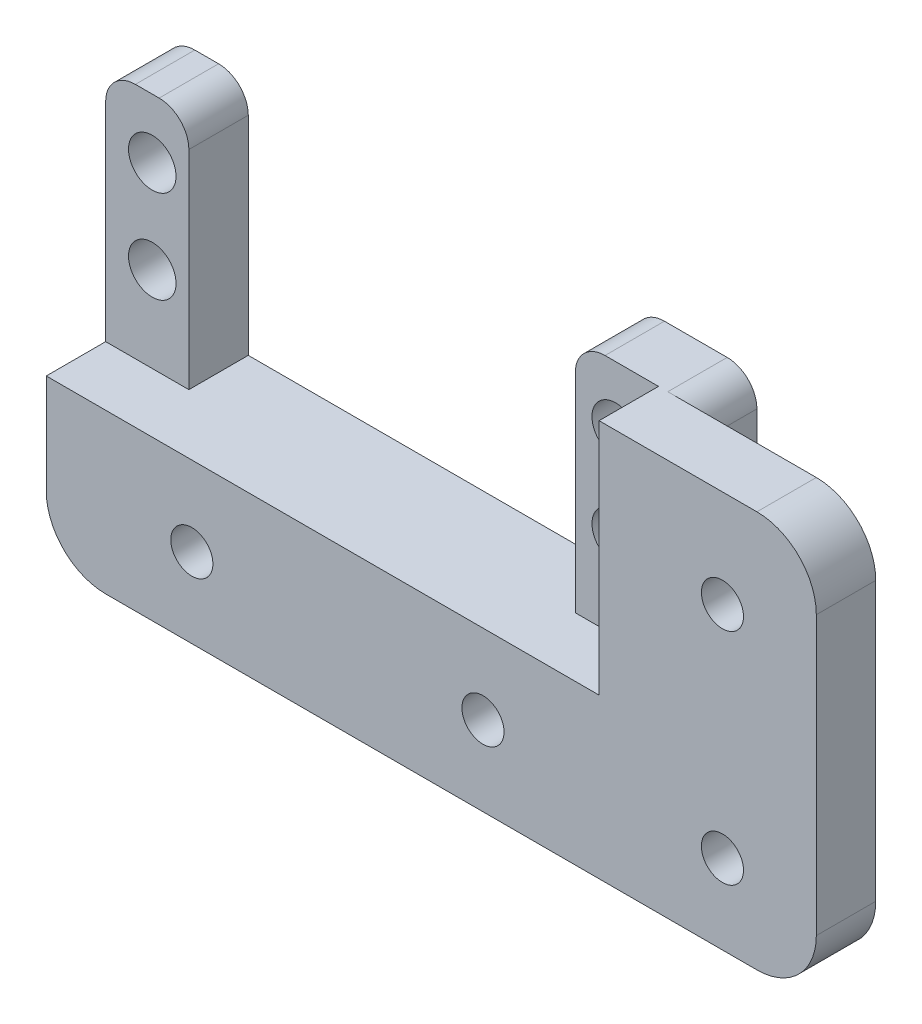
ISO-10303-21;
HEADER;
FILE_DESCRIPTION(('STEP AP214'),'2;1');
FILE_NAME('part.step','',(''),(''),'','','');
FILE_SCHEMA(('AUTOMOTIVE_DESIGN { 1 0 10303 214 1 1 1 1 }'));
ENDSEC;
DATA;
#1=APPLICATION_CONTEXT('core data for automotive mechanical design processes');
#2=APPLICATION_PROTOCOL_DEFINITION('international standard','automotive_design',2000,#1);
#3=PRODUCT_CONTEXT('',#1,'mechanical');
#4=PRODUCT('Part','Part','',(#3));
#5=PRODUCT_RELATED_PRODUCT_CATEGORY('part','',(#4));
#6=PRODUCT_DEFINITION_FORMATION('','',#4);
#7=PRODUCT_DEFINITION_CONTEXT('part definition',#1,'design');
#8=PRODUCT_DEFINITION('design','',#6,#7);
#9=PRODUCT_DEFINITION_SHAPE('','',#8);
#10=(LENGTH_UNIT() NAMED_UNIT(*) SI_UNIT(.MILLI.,.METRE.));
#11=(NAMED_UNIT(*) PLANE_ANGLE_UNIT() SI_UNIT($,.RADIAN.));
#12=(NAMED_UNIT(*) SI_UNIT($,.STERADIAN.) SOLID_ANGLE_UNIT());
#13=UNCERTAINTY_MEASURE_WITH_UNIT(LENGTH_MEASURE(1.E-05),#10,'distance_accuracy_value','');
#14=(GEOMETRIC_REPRESENTATION_CONTEXT(3) GLOBAL_UNCERTAINTY_ASSIGNED_CONTEXT((#13)) GLOBAL_UNIT_ASSIGNED_CONTEXT((#10,
#11,#12)) REPRESENTATION_CONTEXT('',''));
#15=CARTESIAN_POINT('',(0.,0.,0.));
#16=DIRECTION('',(0.,0.,1.));
#17=DIRECTION('',(1.,0.,0.));
#18=AXIS2_PLACEMENT_3D('',#15,#16,#17);
#19=CARTESIAN_POINT('',(3853.51485563994,23.4830508995287,59.608467849632));
#20=DIRECTION('',(0.,0.,-1.));
#21=DIRECTION('',(-1.,0.,0.));
#22=AXIS2_PLACEMENT_3D('',#19,#20,#21);
#23=CYLINDRICAL_SURFACE('',#22,2.25000000000012);
#24=CARTESIAN_POINT('',(3853.51485563994,23.4830508995287,12.7));
#25=DIRECTION('',(0.,0.,1.));
#26=DIRECTION('',(1.,0.,0.));
#27=AXIS2_PLACEMENT_3D('',#24,#25,#26);
#28=CIRCLE('',#27,2.25000000000012);
#29=CARTESIAN_POINT('',(3855.76485563994,23.4830508995287,12.7));
#30=VERTEX_POINT('',#29);
#31=EDGE_CURVE('E411',#30,#30,#28,.F.);
#32=ORIENTED_EDGE('',*,*,#31,.F.);
#33=EDGE_LOOP('',(#32));
#34=FACE_BOUND('',#33,.T.);
#35=CARTESIAN_POINT('',(3853.51485563994,23.4830508995287,6.35));
#36=DIRECTION('',(0.,0.,-1.));
#37=DIRECTION('',(-1.,0.,0.));
#38=AXIS2_PLACEMENT_3D('',#35,#36,#37);
#39=CIRCLE('',#38,2.25000000000012);
#40=CARTESIAN_POINT('',(3851.26485563994,23.4830508995287,6.35));
#41=VERTEX_POINT('',#40);
#42=EDGE_CURVE('E389',#41,#41,#39,.F.);
#43=ORIENTED_EDGE('',*,*,#42,.F.);
#44=EDGE_LOOP('',(#43));
#45=FACE_BOUND('',#44,.T.);
#46=ADVANCED_FACE('F38',(#34,#45),#23,.F.);
#47=CARTESIAN_POINT('',(3853.51485563994,0.,59.608467849632));
#48=DIRECTION('',(0.,0.,-1.));
#49=DIRECTION('',(-1.,0.,0.));
#50=AXIS2_PLACEMENT_3D('',#47,#48,#49);
#51=CYLINDRICAL_SURFACE('',#50,2.25000000000012);
#52=CARTESIAN_POINT('',(3853.51485563994,0.,12.7));
#53=DIRECTION('',(0.,0.,1.));
#54=DIRECTION('',(1.,0.,0.));
#55=AXIS2_PLACEMENT_3D('',#52,#53,#54);
#56=CIRCLE('',#55,2.25000000000012);
#57=CARTESIAN_POINT('',(3855.76485563994,0.,12.7));
#58=VERTEX_POINT('',#57);
#59=EDGE_CURVE('E400',#58,#58,#56,.F.);
#60=ORIENTED_EDGE('',*,*,#59,.F.);
#61=EDGE_LOOP('',(#60));
#62=FACE_BOUND('',#61,.T.);
#63=CARTESIAN_POINT('',(3853.51485563994,0.,6.35));
#64=DIRECTION('',(0.,0.,-1.));
#65=DIRECTION('',(-1.,0.,0.));
#66=AXIS2_PLACEMENT_3D('',#63,#64,#65);
#67=CIRCLE('',#66,2.25000000000012);
#68=CARTESIAN_POINT('',(3851.26485563994,0.,6.35));
#69=VERTEX_POINT('',#68);
#70=EDGE_CURVE('E386',#69,#69,#67,.F.);
#71=ORIENTED_EDGE('',*,*,#70,.F.);
#72=EDGE_LOOP('',(#71));
#73=FACE_BOUND('',#72,.T.);
#74=ADVANCED_FACE('F491',(#62,#73),#51,.F.);
#75=CARTESIAN_POINT('',(3863.54785563994,0.,59.608467849632));
#76=DIRECTION('',(-1.,0.,0.));
#77=DIRECTION('',(0.,0.,1.));
#78=AXIS2_PLACEMENT_3D('',#75,#76,#77);
#79=PLANE('',#78);
#80=DIRECTION('',(0.,-1.,0.));
#81=VECTOR('',#80,1.);
#82=CARTESIAN_POINT('',(3863.54785563994,33.8999999999998,6.35));
#83=LINE('',#82,#81);
#84=CARTESIAN_POINT('',(3863.54785563994,27.5499999999998,6.35));
#85=VERTEX_POINT('',#84);
#86=CARTESIAN_POINT('',(3863.54785563994,-2.14999999999978,6.35));
#87=VERTEX_POINT('',#86);
#88=EDGE_CURVE('E378',#85,#87,#83,.T.);
#89=ORIENTED_EDGE('',*,*,#88,.F.);
#90=DIRECTION('',(0.,0.,-1.));
#91=VECTOR('',#90,1.);
#92=CARTESIAN_POINT('',(3863.54785563994,27.5499999999998,12.7));
#93=LINE('',#92,#91);
#94=CARTESIAN_POINT('',(3863.54785563994,27.5499999999998,12.7));
#95=VERTEX_POINT('',#94);
#96=EDGE_CURVE('E298',#85,#95,#93,.F.);
#97=ORIENTED_EDGE('',*,*,#96,.T.);
#98=DIRECTION('',(0.,1.,0.));
#99=VECTOR('',#98,1.);
#100=CARTESIAN_POINT('',(3863.54785563994,0.,12.7));
#101=LINE('',#100,#99);
#102=CARTESIAN_POINT('',(3863.54785563994,-2.14999999999978,12.7));
#103=VERTEX_POINT('',#102);
#104=EDGE_CURVE('E415',#103,#95,#101,.T.);
#105=ORIENTED_EDGE('',*,*,#104,.F.);
#106=DIRECTION('',(0.,0.,-1.));
#107=VECTOR('',#106,1.);
#108=CARTESIAN_POINT('',(3863.54785563994,-2.14999999999978,59.608467849632));
#109=LINE('',#108,#107);
#110=EDGE_CURVE('E295',#103,#87,#109,.T.);
#111=ORIENTED_EDGE('',*,*,#110,.T.);
#112=EDGE_LOOP('',(#89,#97,#105,#111));
#113=FACE_BOUND('',#112,.T.);
#114=ADVANCED_FACE('F497',(#113),#79,.F.);
#115=CARTESIAN_POINT('',(0.,8.49999999999982,12.7));
#116=DIRECTION('',(0.,1.,0.));
#117=DIRECTION('',(-1.,0.,0.));
#118=AXIS2_PLACEMENT_3D('',#115,#116,#117);
#119=PLANE('',#118);
#120=DIRECTION('',(0.,0.,-1.));
#121=VECTOR('',#120,1.);
#122=CARTESIAN_POINT('',(3790.14185563994,8.49999999999982,0.));
#123=LINE('',#122,#121);
#124=CARTESIAN_POINT('',(3790.14185563994,8.49999999999982,6.35));
#125=VERTEX_POINT('',#124);
#126=CARTESIAN_POINT('',(3790.14185563994,8.50000000000014,0.));
#127=VERTEX_POINT('',#126);
#128=EDGE_CURVE('E183',#125,#127,#123,.T.);
#129=ORIENTED_EDGE('',*,*,#128,.F.);
#130=DIRECTION('',(1.,0.,0.));
#131=VECTOR('',#130,1.);
#132=CARTESIAN_POINT('',(3790.14185563994,8.49999999999982,6.35));
#133=LINE('',#132,#131);
#134=CARTESIAN_POINT('',(3781.25185563994,8.49999999999982,6.35));
#135=VERTEX_POINT('',#134);
#136=EDGE_CURVE('E186',#135,#125,#133,.T.);
#137=ORIENTED_EDGE('',*,*,#136,.F.);
#138=DIRECTION('',(0.,0.,-1.));
#139=VECTOR('',#138,1.);
#140=CARTESIAN_POINT('',(3781.25185563994,8.50000000000014,12.7));
#141=LINE('',#140,#139);
#142=CARTESIAN_POINT('',(3781.25185563994,8.50000000000014,12.7));
#143=VERTEX_POINT('',#142);
#144=EDGE_CURVE('E257',#143,#135,#141,.T.);
#145=ORIENTED_EDGE('',*,*,#144,.F.);
#146=DIRECTION('',(1.,0.,0.));
#147=VECTOR('',#146,1.);
#148=CARTESIAN_POINT('',(0.,8.49999999999982,12.7));
#149=LINE('',#148,#147);
#150=CARTESIAN_POINT('',(3840.33225563994,8.50000000000014,12.7));
#151=VERTEX_POINT('',#150);
#152=EDGE_CURVE('E242',#143,#151,#149,.T.);
#153=ORIENTED_EDGE('',*,*,#152,.T.);
#154=DIRECTION('',(0.,0.,1.));
#155=VECTOR('',#154,1.);
#156=CARTESIAN_POINT('',(3840.33225563994,8.49999999999982,6.35));
#157=LINE('',#156,#155);
#158=CARTESIAN_POINT('',(3840.33225563994,8.49999999999982,6.35));
#159=VERTEX_POINT('',#158);
#160=EDGE_CURVE('E218',#159,#151,#157,.T.);
#161=ORIENTED_EDGE('',*,*,#160,.F.);
#162=DIRECTION('',(1.,0.,0.));
#163=VECTOR('',#162,1.);
#164=CARTESIAN_POINT('',(3831.44225563994,8.49999999999982,6.35));
#165=LINE('',#164,#163);
#166=CARTESIAN_POINT('',(3831.44225563994,8.49999999999982,6.35));
#167=VERTEX_POINT('',#166);
#168=EDGE_CURVE('E228',#167,#159,#165,.T.);
#169=ORIENTED_EDGE('',*,*,#168,.F.);
#170=DIRECTION('',(0.,0.,1.));
#171=VECTOR('',#170,1.);
#172=CARTESIAN_POINT('',(3831.44225563994,8.49999999999982,0.));
#173=LINE('',#172,#171);
#174=CARTESIAN_POINT('',(3831.44225563994,8.50000000000014,0.));
#175=VERTEX_POINT('',#174);
#176=EDGE_CURVE('E209',#175,#167,#173,.T.);
#177=ORIENTED_EDGE('',*,*,#176,.F.);
#178=DIRECTION('',(1.,0.,0.));
#179=VECTOR('',#178,1.);
#180=CARTESIAN_POINT('',(0.,8.49999999999982,0.));
#181=LINE('',#180,#179);
#182=EDGE_CURVE('E197',#127,#175,#181,.T.);
#183=ORIENTED_EDGE('',*,*,#182,.F.);
#184=EDGE_LOOP('',(#129,#137,#145,#153,#161,#169,#177,#183));
#185=FACE_BOUND('',#184,.T.);
#186=ADVANCED_FACE('F194',(#185),#119,.T.);
#187=CARTESIAN_POINT('',(3781.25185563994,0.,12.7));
#188=DIRECTION('',(1.,0.,0.));
#189=DIRECTION('',(0.,0.,-1.));
#190=AXIS2_PLACEMENT_3D('',#187,#188,#189);
#191=PLANE('',#190);
#192=DIRECTION('',(0.,-1.,0.));
#193=VECTOR('',#192,1.);
#194=CARTESIAN_POINT('',(3781.25185563994,44.824953089144,6.35));
#195=LINE('',#194,#193);
#196=CARTESIAN_POINT('',(3781.25185563994,30.7249999999998,6.35));
#197=VERTEX_POINT('',#196);
#198=EDGE_CURVE('E190',#197,#135,#195,.T.);
#199=ORIENTED_EDGE('',*,*,#198,.F.);
#200=DIRECTION('',(0.,0.,1.));
#201=VECTOR('',#200,1.);
#202=CARTESIAN_POINT('',(3781.25185563994,30.7249999999998,0.));
#203=LINE('',#202,#201);
#204=CARTESIAN_POINT('',(3781.25185563994,30.7249999999998,0.));
#205=VERTEX_POINT('',#204);
#206=EDGE_CURVE('E331',#197,#205,#203,.F.);
#207=ORIENTED_EDGE('',*,*,#206,.T.);
#208=DIRECTION('',(0.,-1.,0.));
#209=VECTOR('',#208,1.);
#210=CARTESIAN_POINT('',(3781.25185563994,0.,0.));
#211=LINE('',#210,#209);
#212=CARTESIAN_POINT('',(3781.25185563994,-2.14999999999978,0.));
#213=VERTEX_POINT('',#212);
#214=EDGE_CURVE('E259',#205,#213,#211,.T.);
#215=ORIENTED_EDGE('',*,*,#214,.T.);
#216=DIRECTION('',(0.,0.,-1.));
#217=VECTOR('',#216,1.);
#218=CARTESIAN_POINT('',(3781.25185563994,-2.14999999999978,12.7));
#219=LINE('',#218,#217);
#220=CARTESIAN_POINT('',(3781.25185563994,-2.14999999999978,12.7));
#221=VERTEX_POINT('',#220);
#222=EDGE_CURVE('E280',#213,#221,#219,.F.);
#223=ORIENTED_EDGE('',*,*,#222,.T.);
#224=DIRECTION('',(0.,-1.,0.));
#225=VECTOR('',#224,1.);
#226=CARTESIAN_POINT('',(3781.25185563994,0.,12.7));
#227=LINE('',#226,#225);
#228=EDGE_CURVE('E244',#143,#221,#227,.T.);
#229=ORIENTED_EDGE('',*,*,#228,.F.);
#230=ORIENTED_EDGE('',*,*,#144,.T.);
#231=EDGE_LOOP('',(#199,#207,#215,#223,#229,#230));
#232=FACE_BOUND('',#231,.T.);
#233=ADVANCED_FACE('F335',(#232),#191,.F.);
#234=CARTESIAN_POINT('',(3827.92435563994,1.05374697725812E-13,12.7));
#235=DIRECTION('',(0.,0.,-1.));
#236=DIRECTION('',(-1.,0.,0.));
#237=AXIS2_PLACEMENT_3D('',#234,#235,#236);
#238=CYLINDRICAL_SURFACE('',#237,2.25000000000012);
#239=CARTESIAN_POINT('',(3827.92435563994,1.05374697725812E-13,6.35));
#240=DIRECTION('',(0.,0.,1.));
#241=DIRECTION('',(1.,0.,0.));
#242=AXIS2_PLACEMENT_3D('',#239,#240,#241);
#243=CIRCLE('',#242,2.25000000000012);
#244=CARTESIAN_POINT('',(3830.17435563994,1.05374697725812E-13,6.35));
#245=VERTEX_POINT('',#244);
#246=EDGE_CURVE('E393',#245,#245,#243,.T.);
#247=ORIENTED_EDGE('',*,*,#246,.F.);
#248=EDGE_LOOP('',(#247));
#249=FACE_BOUND('',#248,.T.);
#250=CARTESIAN_POINT('',(3827.92435563994,1.05374697725812E-13,12.7));
#251=DIRECTION('',(0.,0.,1.));
#252=DIRECTION('',(1.,0.,0.));
#253=AXIS2_PLACEMENT_3D('',#250,#251,#252);
#254=CIRCLE('',#253,2.25000000000012);
#255=CARTESIAN_POINT('',(3830.17435563994,1.05374697725812E-13,12.7));
#256=VERTEX_POINT('',#255);
#257=EDGE_CURVE('E251',#256,#256,#254,.T.);
#258=ORIENTED_EDGE('',*,*,#257,.T.);
#259=EDGE_LOOP('',(#258));
#260=FACE_BOUND('',#259,.T.);
#261=ADVANCED_FACE('F546',(#249,#260),#238,.F.);
#262=CARTESIAN_POINT('',(0.,-8.49999999999978,12.7));
#263=DIRECTION('',(0.,1.,0.));
#264=DIRECTION('',(0.,0.,1.));
#265=AXIS2_PLACEMENT_3D('',#262,#263,#264);
#266=PLANE('',#265);
#267=DIRECTION('',(1.,0.,0.));
#268=VECTOR('',#267,1.);
#269=CARTESIAN_POINT('',(0.,-8.49999999999978,0.));
#270=LINE('',#269,#268);
#271=CARTESIAN_POINT('',(3787.60185563994,-8.49999999999978,0.));
#272=VERTEX_POINT('',#271);
#273=CARTESIAN_POINT('',(3838.14785563994,-8.49999999999978,0.));
#274=VERTEX_POINT('',#273);
#275=EDGE_CURVE('E245',#272,#274,#270,.T.);
#276=ORIENTED_EDGE('',*,*,#275,.T.);
#277=DIRECTION('',(0.,0.,-1.));
#278=VECTOR('',#277,1.);
#279=CARTESIAN_POINT('',(3838.14785563994,-8.49999999999978,12.7));
#280=LINE('',#279,#278);
#281=CARTESIAN_POINT('',(3838.14785563994,-8.49999999999978,6.35));
#282=VERTEX_POINT('',#281);
#283=EDGE_CURVE('E277',#274,#282,#280,.F.);
#284=ORIENTED_EDGE('',*,*,#283,.T.);
#285=DIRECTION('',(-1.,0.,0.));
#286=VECTOR('',#285,1.);
#287=CARTESIAN_POINT('',(3863.54785563994,-8.49999999999979,6.35));
#288=LINE('',#287,#286);
#289=CARTESIAN_POINT('',(3857.19785563994,-8.49999999999979,6.35));
#290=VERTEX_POINT('',#289);
#291=EDGE_CURVE('E381',#290,#282,#288,.T.);
#292=ORIENTED_EDGE('',*,*,#291,.F.);
#293=DIRECTION('',(0.,0.,-1.));
#294=VECTOR('',#293,1.);
#295=CARTESIAN_POINT('',(3857.19785563994,-8.49999999999978,12.7));
#296=LINE('',#295,#294);
#297=CARTESIAN_POINT('',(3857.19785563994,-8.49999999999978,12.7));
#298=VERTEX_POINT('',#297);
#299=EDGE_CURVE('E272',#290,#298,#296,.F.);
#300=ORIENTED_EDGE('',*,*,#299,.T.);
#301=DIRECTION('',(1.,0.,0.));
#302=VECTOR('',#301,1.);
#303=CARTESIAN_POINT('',(0.,-8.49999999999978,12.7));
#304=LINE('',#303,#302);
#305=CARTESIAN_POINT('',(3787.60185563994,-8.49999999999978,12.7));
#306=VERTEX_POINT('',#305);
#307=EDGE_CURVE('E248',#306,#298,#304,.T.);
#308=ORIENTED_EDGE('',*,*,#307,.F.);
#309=DIRECTION('',(0.,0.,-1.));
#310=VECTOR('',#309,1.);
#311=CARTESIAN_POINT('',(3787.60185563994,-8.49999999999978,12.7));
#312=LINE('',#311,#310);
#313=EDGE_CURVE('E274',#306,#272,#312,.T.);
#314=ORIENTED_EDGE('',*,*,#313,.T.);
#315=EDGE_LOOP('',(#276,#284,#292,#300,#308,#314));
#316=FACE_BOUND('',#315,.T.);
#317=ADVANCED_FACE('F476',(#316),#266,.F.);
#318=CARTESIAN_POINT('',(3796.80935563994,1.83792261813435E-13,12.7));
#319=DIRECTION('',(0.,0.,-1.));
#320=DIRECTION('',(-1.,0.,0.));
#321=AXIS2_PLACEMENT_3D('',#318,#319,#320);
#322=CYLINDRICAL_SURFACE('',#321,2.25000000000012);
#323=CARTESIAN_POINT('',(3796.80935563994,1.83792261813435E-13,6.35));
#324=DIRECTION('',(0.,0.,1.));
#325=DIRECTION('',(1.,0.,0.));
#326=AXIS2_PLACEMENT_3D('',#323,#324,#325);
#327=CIRCLE('',#326,2.25000000000012);
#328=CARTESIAN_POINT('',(3799.05935563994,1.83792261813435E-13,6.35));
#329=VERTEX_POINT('',#328);
#330=EDGE_CURVE('E404',#329,#329,#327,.T.);
#331=ORIENTED_EDGE('',*,*,#330,.F.);
#332=EDGE_LOOP('',(#331));
#333=FACE_BOUND('',#332,.T.);
#334=CARTESIAN_POINT('',(3796.80935563994,1.83792261813435E-13,12.7));
#335=DIRECTION('',(0.,0.,1.));
#336=DIRECTION('',(1.,0.,0.));
#337=AXIS2_PLACEMENT_3D('',#334,#335,#336);
#338=CIRCLE('',#337,2.25000000000012);
#339=CARTESIAN_POINT('',(3799.05935563994,1.83792261813435E-13,12.7));
#340=VERTEX_POINT('',#339);
#341=EDGE_CURVE('E254',#340,#340,#338,.T.);
#342=ORIENTED_EDGE('',*,*,#341,.T.);
#343=EDGE_LOOP('',(#342));
#344=FACE_BOUND('',#343,.T.);
#345=ADVANCED_FACE('F539',(#333,#344),#322,.F.);
#346=CARTESIAN_POINT('',(0.,0.,12.7));
#347=DIRECTION('',(0.,0.,1.));
#348=DIRECTION('',(1.,0.,0.));
#349=AXIS2_PLACEMENT_3D('',#346,#347,#348);
#350=PLANE('',#349);
#351=ORIENTED_EDGE('',*,*,#228,.T.);
#352=CARTESIAN_POINT('',(3787.60185563994,-2.14999999999978,12.7));
#353=DIRECTION('',(0.,0.,1.));
#354=DIRECTION('',(1.,0.,0.));
#355=AXIS2_PLACEMENT_3D('',#352,#353,#354);
#356=CIRCLE('',#355,6.35);
#357=EDGE_CURVE('E286',#221,#306,#356,.T.);
#358=ORIENTED_EDGE('',*,*,#357,.T.);
#359=ORIENTED_EDGE('',*,*,#307,.T.);
#360=CARTESIAN_POINT('',(3857.19785563994,-2.14999999999978,12.7));
#361=DIRECTION('',(0.,0.,1.));
#362=DIRECTION('',(1.,0.,0.));
#363=AXIS2_PLACEMENT_3D('',#360,#361,#362);
#364=CIRCLE('',#363,6.35);
#365=EDGE_CURVE('E282',#298,#103,#364,.T.);
#366=ORIENTED_EDGE('',*,*,#365,.T.);
#367=ORIENTED_EDGE('',*,*,#104,.T.);
#368=CARTESIAN_POINT('',(3857.19785563994,27.5499999999998,12.7));
#369=DIRECTION('',(0.,0.,1.));
#370=DIRECTION('',(1.,0.,0.));
#371=AXIS2_PLACEMENT_3D('',#368,#369,#370);
#372=CIRCLE('',#371,6.35);
#373=CARTESIAN_POINT('',(3857.19785563994,33.8999999999998,12.7));
#374=VERTEX_POINT('',#373);
#375=EDGE_CURVE('E284',#95,#374,#372,.T.);
#376=ORIENTED_EDGE('',*,*,#375,.T.);
#377=DIRECTION('',(1.,0.,0.));
#378=VECTOR('',#377,1.);
#379=CARTESIAN_POINT('',(3840.33225563994,33.8999999999998,12.7));
#380=LINE('',#379,#378);
#381=CARTESIAN_POINT('',(3840.33225563994,33.8999999999998,12.7));
#382=VERTEX_POINT('',#381);
#383=EDGE_CURVE('E222',#382,#374,#380,.T.);
#384=ORIENTED_EDGE('',*,*,#383,.F.);
#385=DIRECTION('',(0.,-1.,0.));
#386=VECTOR('',#385,1.);
#387=CARTESIAN_POINT('',(3840.33225563994,33.8999999999998,12.7));
#388=LINE('',#387,#386);
#389=EDGE_CURVE('E225',#382,#151,#388,.T.);
#390=ORIENTED_EDGE('',*,*,#389,.T.);
#391=ORIENTED_EDGE('',*,*,#152,.F.);
#392=EDGE_LOOP('',(#351,#358,#359,#366,#367,#376,#384,#390,#391));
#393=FACE_BOUND('',#392,.T.);
#394=ORIENTED_EDGE('',*,*,#257,.F.);
#395=EDGE_LOOP('',(#394));
#396=FACE_BOUND('',#395,.T.);
#397=ORIENTED_EDGE('',*,*,#341,.F.);
#398=EDGE_LOOP('',(#397));
#399=FACE_BOUND('',#398,.T.);
#400=ORIENTED_EDGE('',*,*,#59,.T.);
#401=EDGE_LOOP('',(#400));
#402=FACE_BOUND('',#401,.T.);
#403=ORIENTED_EDGE('',*,*,#31,.T.);
#404=EDGE_LOOP('',(#403));
#405=FACE_BOUND('',#404,.T.);
#406=ADVANCED_FACE('F458',(#393,#396,#399,#402,#405),#350,.T.);
#407=CARTESIAN_POINT('',(0.,0.,0.));
#408=DIRECTION('',(0.,0.,1.));
#409=DIRECTION('',(1.,0.,0.));
#410=AXIS2_PLACEMENT_3D('',#407,#408,#409);
#411=PLANE('',#410);
#412=CARTESIAN_POINT('',(3827.92435563994,1.05374697725812E-13,0.));
#413=DIRECTION('',(0.,0.,-1.));
#414=DIRECTION('',(-1.,0.,0.));
#415=AXIS2_PLACEMENT_3D('',#412,#413,#414);
#416=CIRCLE('',#415,6.34999999999972);
#417=CARTESIAN_POINT('',(3821.57435563994,1.05374697725812E-13,0.));
#418=VERTEX_POINT('',#417);
#419=EDGE_CURVE('E396',#418,#418,#416,.T.);
#420=ORIENTED_EDGE('',*,*,#419,.F.);
#421=EDGE_LOOP('',(#420));
#422=FACE_BOUND('',#421,.T.);
#423=CARTESIAN_POINT('',(3796.80935563994,1.83792261813435E-13,0.));
#424=DIRECTION('',(0.,0.,-1.));
#425=DIRECTION('',(-1.,0.,0.));
#426=AXIS2_PLACEMENT_3D('',#423,#424,#425);
#427=CIRCLE('',#426,6.34999999999972);
#428=CARTESIAN_POINT('',(3790.45935563994,1.83792261813435E-13,0.));
#429=VERTEX_POINT('',#428);
#430=EDGE_CURVE('E403',#429,#429,#427,.T.);
#431=ORIENTED_EDGE('',*,*,#430,.F.);
#432=EDGE_LOOP('',(#431));
#433=FACE_BOUND('',#432,.T.);
#434=CARTESIAN_POINT('',(3786.23025563994,27.5499999999998,0.));
#435=DIRECTION('',(0.,0.,1.));
#436=DIRECTION('',(1.,0.,0.));
#437=AXIS2_PLACEMENT_3D('',#434,#435,#436);
#438=CIRCLE('',#437,2.54000000000008);
#439=CARTESIAN_POINT('',(3788.77025563994,27.5499999999998,0.));
#440=VERTEX_POINT('',#439);
#441=EDGE_CURVE('E432',#440,#440,#438,.T.);
#442=ORIENTED_EDGE('',*,*,#441,.T.);
#443=EDGE_LOOP('',(#442));
#444=FACE_BOUND('',#443,.T.);
#445=CARTESIAN_POINT('',(3786.23025563994,17.6439999999998,0.));
#446=DIRECTION('',(0.,0.,1.));
#447=DIRECTION('',(1.,0.,0.));
#448=AXIS2_PLACEMENT_3D('',#445,#446,#447);
#449=CIRCLE('',#448,2.54000000000008);
#450=CARTESIAN_POINT('',(3788.77025563994,17.6439999999998,0.));
#451=VERTEX_POINT('',#450);
#452=EDGE_CURVE('E426',#451,#451,#449,.T.);
#453=ORIENTED_EDGE('',*,*,#452,.T.);
#454=EDGE_LOOP('',(#453));
#455=FACE_BOUND('',#454,.T.);
#456=CARTESIAN_POINT('',(3835.76025563994,17.6439999999998,0.));
#457=DIRECTION('',(0.,0.,1.));
#458=DIRECTION('',(1.,0.,0.));
#459=AXIS2_PLACEMENT_3D('',#456,#457,#458);
#460=CIRCLE('',#459,2.54000000000008);
#461=CARTESIAN_POINT('',(3838.30025563994,17.6439999999998,0.));
#462=VERTEX_POINT('',#461);
#463=EDGE_CURVE('E420',#462,#462,#460,.T.);
#464=ORIENTED_EDGE('',*,*,#463,.T.);
#465=EDGE_LOOP('',(#464));
#466=FACE_BOUND('',#465,.T.);
#467=CARTESIAN_POINT('',(3835.76025563994,27.5499999999998,0.));
#468=DIRECTION('',(0.,0.,1.));
#469=DIRECTION('',(1.,0.,0.));
#470=AXIS2_PLACEMENT_3D('',#467,#468,#469);
#471=CIRCLE('',#470,2.54000000000008);
#472=CARTESIAN_POINT('',(3838.30025563994,27.5499999999998,0.));
#473=VERTEX_POINT('',#472);
#474=EDGE_CURVE('E212',#473,#473,#471,.T.);
#475=ORIENTED_EDGE('',*,*,#474,.T.);
#476=EDGE_LOOP('',(#475));
#477=FACE_BOUND('',#476,.T.);
#478=DIRECTION('',(-1.,0.,0.));
#479=VECTOR('',#478,1.);
#480=CARTESIAN_POINT('',(3843.48185563994,33.8999999999998,0.));
#481=LINE('',#480,#479);
#482=CARTESIAN_POINT('',(3841.32285563994,33.8999999999998,0.));
#483=VERTEX_POINT('',#482);
#484=CARTESIAN_POINT('',(3834.61725563994,33.8999999999998,0.));
#485=VERTEX_POINT('',#484);
#486=EDGE_CURVE('E214',#483,#485,#481,.T.);
#487=ORIENTED_EDGE('',*,*,#486,.F.);
#488=CARTESIAN_POINT('',(3841.32285563994,30.7249999999998,0.));
#489=DIRECTION('',(0.,0.,1.));
#490=DIRECTION('',(1.,0.,0.));
#491=AXIS2_PLACEMENT_3D('',#488,#489,#490);
#492=CIRCLE('',#491,3.175);
#493=CARTESIAN_POINT('',(3844.49785563994,30.7249999999998,0.));
#494=VERTEX_POINT('',#493);
#495=EDGE_CURVE('E314',#483,#494,#492,.F.);
#496=ORIENTED_EDGE('',*,*,#495,.T.);
#497=DIRECTION('',(0.,1.,0.));
#498=VECTOR('',#497,1.);
#499=CARTESIAN_POINT('',(3844.49785563994,33.8999999999998,0.));
#500=LINE('',#499,#498);
#501=CARTESIAN_POINT('',(3844.49785563994,-2.14999999999978,0.));
#502=VERTEX_POINT('',#501);
#503=EDGE_CURVE('E372',#502,#494,#500,.T.);
#504=ORIENTED_EDGE('',*,*,#503,.F.);
#505=CARTESIAN_POINT('',(3838.14785563994,-2.14999999999978,0.));
#506=DIRECTION('',(0.,0.,1.));
#507=DIRECTION('',(1.,0.,0.));
#508=AXIS2_PLACEMENT_3D('',#505,#506,#507);
#509=CIRCLE('',#508,6.35);
#510=EDGE_CURVE('E270',#502,#274,#509,.F.);
#511=ORIENTED_EDGE('',*,*,#510,.T.);
#512=ORIENTED_EDGE('',*,*,#275,.F.);
#513=CARTESIAN_POINT('',(3787.60185563994,-2.14999999999978,0.));
#514=DIRECTION('',(0.,0.,1.));
#515=DIRECTION('',(1.,0.,0.));
#516=AXIS2_PLACEMENT_3D('',#513,#514,#515);
#517=CIRCLE('',#516,6.35);
#518=EDGE_CURVE('E267',#272,#213,#517,.F.);
#519=ORIENTED_EDGE('',*,*,#518,.T.);
#520=ORIENTED_EDGE('',*,*,#214,.F.);
#521=CARTESIAN_POINT('',(3784.42685563994,30.7249999999998,0.));
#522=DIRECTION('',(0.,0.,1.));
#523=DIRECTION('',(1.,0.,0.));
#524=AXIS2_PLACEMENT_3D('',#521,#522,#523);
#525=CIRCLE('',#524,3.175);
#526=CARTESIAN_POINT('',(3784.42685563994,33.8999999999998,0.));
#527=VERTEX_POINT('',#526);
#528=EDGE_CURVE('E310',#205,#527,#525,.F.);
#529=ORIENTED_EDGE('',*,*,#528,.T.);
#530=DIRECTION('',(-1.,0.,0.));
#531=VECTOR('',#530,1.);
#532=CARTESIAN_POINT('',(3781.25185563994,33.8999999999998,0.));
#533=LINE('',#532,#531);
#534=CARTESIAN_POINT('',(3786.96685563994,33.8999999999998,0.));
#535=VERTEX_POINT('',#534);
#536=EDGE_CURVE('E200',#535,#527,#533,.T.);
#537=ORIENTED_EDGE('',*,*,#536,.F.);
#538=CARTESIAN_POINT('',(3786.96685563994,30.7249999999998,0.));
#539=DIRECTION('',(0.,0.,1.));
#540=DIRECTION('',(1.,0.,0.));
#541=AXIS2_PLACEMENT_3D('',#538,#539,#540);
#542=CIRCLE('',#541,3.175);
#543=CARTESIAN_POINT('',(3790.14185563994,30.7249999999998,0.));
#544=VERTEX_POINT('',#543);
#545=EDGE_CURVE('E308',#535,#544,#542,.F.);
#546=ORIENTED_EDGE('',*,*,#545,.T.);
#547=DIRECTION('',(0.,-1.,0.));
#548=VECTOR('',#547,1.);
#549=CARTESIAN_POINT('',(3790.14185563994,44.824953089144,0.));
#550=LINE('',#549,#548);
#551=EDGE_CURVE('E198',#544,#127,#550,.T.);
#552=ORIENTED_EDGE('',*,*,#551,.T.);
#553=ORIENTED_EDGE('',*,*,#182,.T.);
#554=DIRECTION('',(0.,-1.,0.));
#555=VECTOR('',#554,1.);
#556=CARTESIAN_POINT('',(3831.44225563994,33.8999999999998,0.));
#557=LINE('',#556,#555);
#558=CARTESIAN_POINT('',(3831.44225563994,30.7249999999998,0.));
#559=VERTEX_POINT('',#558);
#560=EDGE_CURVE('E240',#559,#175,#557,.T.);
#561=ORIENTED_EDGE('',*,*,#560,.F.);
#562=CARTESIAN_POINT('',(3834.61725563994,30.7249999999998,0.));
#563=DIRECTION('',(0.,0.,1.));
#564=DIRECTION('',(1.,0.,0.));
#565=AXIS2_PLACEMENT_3D('',#562,#563,#564);
#566=CIRCLE('',#565,3.175);
#567=EDGE_CURVE('E312',#559,#485,#566,.F.);
#568=ORIENTED_EDGE('',*,*,#567,.T.);
#569=EDGE_LOOP('',(#487,#496,#504,#511,#512,#519,#520,#529,#537,#546,#552,#553,#561,#568));
#570=FACE_BOUND('',#569,.T.);
#571=ADVANCED_FACE('F340',(#422,#433,#444,#455,#466,#477,#570),#411,.F.);
#572=CARTESIAN_POINT('',(3831.44225563994,33.8999999999998,0.));
#573=DIRECTION('',(1.,0.,0.));
#574=DIRECTION('',(0.,0.,-1.));
#575=AXIS2_PLACEMENT_3D('',#572,#573,#574);
#576=PLANE('',#575);
#577=DIRECTION('',(0.,-1.,0.));
#578=VECTOR('',#577,1.);
#579=CARTESIAN_POINT('',(3831.44225563994,33.8999999999998,6.35));
#580=LINE('',#579,#578);
#581=CARTESIAN_POINT('',(3831.44225563994,30.7249999999998,6.35));
#582=VERTEX_POINT('',#581);
#583=EDGE_CURVE('E238',#582,#167,#580,.T.);
#584=ORIENTED_EDGE('',*,*,#583,.F.);
#585=DIRECTION('',(0.,0.,1.));
#586=VECTOR('',#585,1.);
#587=CARTESIAN_POINT('',(3831.44225563994,30.7249999999998,0.));
#588=LINE('',#587,#586);
#589=EDGE_CURVE('E320',#582,#559,#588,.F.);
#590=ORIENTED_EDGE('',*,*,#589,.T.);
#591=ORIENTED_EDGE('',*,*,#560,.T.);
#592=ORIENTED_EDGE('',*,*,#176,.T.);
#593=EDGE_LOOP('',(#584,#590,#591,#592));
#594=FACE_BOUND('',#593,.T.);
#595=ADVANCED_FACE('F355',(#594),#576,.F.);
#596=CARTESIAN_POINT('',(3831.44225563994,33.8999999999998,6.35));
#597=DIRECTION('',(0.,0.,-1.));
#598=DIRECTION('',(-1.,0.,0.));
#599=AXIS2_PLACEMENT_3D('',#596,#597,#598);
#600=PLANE('',#599);
#601=CARTESIAN_POINT('',(3835.76025563994,17.6439999999998,6.35000000000074));
#602=DIRECTION('',(0.,0.,1.));
#603=DIRECTION('',(1.,0.,0.));
#604=AXIS2_PLACEMENT_3D('',#601,#602,#603);
#605=CIRCLE('',#604,2.54000000000008);
#606=CARTESIAN_POINT('',(3838.30025563994,17.6439999999998,6.35000000000074));
#607=VERTEX_POINT('',#606);
#608=EDGE_CURVE('E423',#607,#607,#605,.T.);
#609=ORIENTED_EDGE('',*,*,#608,.F.);
#610=EDGE_LOOP('',(#609));
#611=FACE_BOUND('',#610,.T.);
#612=CARTESIAN_POINT('',(3835.76025563994,27.5499999999998,6.35000000000074));
#613=DIRECTION('',(0.,0.,1.));
#614=DIRECTION('',(1.,0.,0.));
#615=AXIS2_PLACEMENT_3D('',#612,#613,#614);
#616=CIRCLE('',#615,2.54000000000008);
#617=CARTESIAN_POINT('',(3838.30025563994,27.5499999999998,6.35000000000074));
#618=VERTEX_POINT('',#617);
#619=EDGE_CURVE('E203',#618,#618,#616,.T.);
#620=ORIENTED_EDGE('',*,*,#619,.F.);
#621=EDGE_LOOP('',(#620));
#622=FACE_BOUND('',#621,.T.);
#623=DIRECTION('',(1.,0.,0.));
#624=VECTOR('',#623,1.);
#625=CARTESIAN_POINT('',(3831.44225563994,33.8999999999998,6.35));
#626=LINE('',#625,#624);
#627=CARTESIAN_POINT('',(3834.61725563994,33.8999999999998,6.35));
#628=VERTEX_POINT('',#627);
#629=CARTESIAN_POINT('',(3840.33225563994,33.8999999999998,6.35));
#630=VERTEX_POINT('',#629);
#631=EDGE_CURVE('E217',#628,#630,#626,.T.);
#632=ORIENTED_EDGE('',*,*,#631,.F.);
#633=CARTESIAN_POINT('',(3834.61725563994,30.7249999999998,6.35));
#634=DIRECTION('',(0.,0.,-1.));
#635=DIRECTION('',(-1.,0.,0.));
#636=AXIS2_PLACEMENT_3D('',#633,#634,#635);
#637=CIRCLE('',#636,3.175);
#638=EDGE_CURVE('E318',#628,#582,#637,.F.);
#639=ORIENTED_EDGE('',*,*,#638,.T.);
#640=ORIENTED_EDGE('',*,*,#583,.T.);
#641=ORIENTED_EDGE('',*,*,#168,.T.);
#642=DIRECTION('',(0.,-1.,0.));
#643=VECTOR('',#642,1.);
#644=CARTESIAN_POINT('',(3840.33225563994,33.8999999999998,6.35));
#645=LINE('',#644,#643);
#646=EDGE_CURVE('E235',#630,#159,#645,.T.);
#647=ORIENTED_EDGE('',*,*,#646,.F.);
#648=EDGE_LOOP('',(#632,#639,#640,#641,#647));
#649=FACE_BOUND('',#648,.T.);
#650=ADVANCED_FACE('F444',(#611,#622,#649),#600,.F.);
#651=CARTESIAN_POINT('',(3840.33225563994,33.8999999999998,6.35));
#652=DIRECTION('',(1.,0.,0.));
#653=DIRECTION('',(0.,0.,-1.));
#654=AXIS2_PLACEMENT_3D('',#651,#652,#653);
#655=PLANE('',#654);
#656=ORIENTED_EDGE('',*,*,#160,.T.);
#657=ORIENTED_EDGE('',*,*,#389,.F.);
#658=DIRECTION('',(0.,0.,1.));
#659=VECTOR('',#658,1.);
#660=CARTESIAN_POINT('',(3840.33225563994,33.8999999999998,6.35));
#661=LINE('',#660,#659);
#662=EDGE_CURVE('E220',#630,#382,#661,.T.);
#663=ORIENTED_EDGE('',*,*,#662,.F.);
#664=ORIENTED_EDGE('',*,*,#646,.T.);
#665=EDGE_LOOP('',(#656,#657,#663,#664));
#666=FACE_BOUND('',#665,.T.);
#667=ADVANCED_FACE('F447',(#666),#655,.F.);
#668=CARTESIAN_POINT('',(0.,33.8999999999998,0.));
#669=DIRECTION('',(0.,1.,0.));
#670=DIRECTION('',(0.,0.,1.));
#671=AXIS2_PLACEMENT_3D('',#668,#669,#670);
#672=PLANE('',#671);
#673=DIRECTION('',(1.,0.,0.));
#674=VECTOR('',#673,1.);
#675=CARTESIAN_POINT('',(3863.54785563994,33.8999999999998,6.35));
#676=LINE('',#675,#674);
#677=CARTESIAN_POINT('',(3841.32285563994,33.8999999999998,6.35));
#678=VERTEX_POINT('',#677);
#679=CARTESIAN_POINT('',(3857.19785563994,33.8999999999998,6.35));
#680=VERTEX_POINT('',#679);
#681=EDGE_CURVE('E365',#678,#680,#676,.T.);
#682=ORIENTED_EDGE('',*,*,#681,.F.);
#683=DIRECTION('',(0.,0.,-1.));
#684=VECTOR('',#683,1.);
#685=CARTESIAN_POINT('',(3841.32285563994,33.8999999999998,0.));
#686=LINE('',#685,#684);
#687=EDGE_CURVE('E305',#678,#483,#686,.T.);
#688=ORIENTED_EDGE('',*,*,#687,.T.);
#689=ORIENTED_EDGE('',*,*,#486,.T.);
#690=DIRECTION('',(0.,0.,1.));
#691=VECTOR('',#690,1.);
#692=CARTESIAN_POINT('',(3834.61725563994,33.8999999999998,6.35));
#693=LINE('',#692,#691);
#694=EDGE_CURVE('E302',#485,#628,#693,.T.);
#695=ORIENTED_EDGE('',*,*,#694,.T.);
#696=ORIENTED_EDGE('',*,*,#631,.T.);
#697=ORIENTED_EDGE('',*,*,#662,.T.);
#698=ORIENTED_EDGE('',*,*,#383,.T.);
#699=DIRECTION('',(0.,0.,-1.));
#700=VECTOR('',#699,1.);
#701=CARTESIAN_POINT('',(3857.19785563994,33.8999999999998,6.35));
#702=LINE('',#701,#700);
#703=EDGE_CURVE('E288',#374,#680,#702,.T.);
#704=ORIENTED_EDGE('',*,*,#703,.T.);
#705=EDGE_LOOP('',(#682,#688,#689,#695,#696,#697,#698,#704));
#706=FACE_BOUND('',#705,.T.);
#707=ADVANCED_FACE('F361',(#706),#672,.T.);
#708=CARTESIAN_POINT('',(3790.14185563994,44.824953089144,6.35));
#709=DIRECTION('',(0.,0.,-1.));
#710=DIRECTION('',(-1.,0.,0.));
#711=AXIS2_PLACEMENT_3D('',#708,#709,#710);
#712=PLANE('',#711);
#713=CARTESIAN_POINT('',(3786.23025563994,27.5499999999998,6.35000000000074));
#714=DIRECTION('',(0.,0.,1.));
#715=DIRECTION('',(1.,0.,0.));
#716=AXIS2_PLACEMENT_3D('',#713,#714,#715);
#717=CIRCLE('',#716,2.54000000000008);
#718=CARTESIAN_POINT('',(3788.77025563994,27.5499999999998,6.35000000000074));
#719=VERTEX_POINT('',#718);
#720=EDGE_CURVE('E414',#719,#719,#717,.T.);
#721=ORIENTED_EDGE('',*,*,#720,.F.);
#722=EDGE_LOOP('',(#721));
#723=FACE_BOUND('',#722,.T.);
#724=CARTESIAN_POINT('',(3786.23025563994,17.6439999999998,6.35000000000074));
#725=DIRECTION('',(0.,0.,1.));
#726=DIRECTION('',(1.,0.,0.));
#727=AXIS2_PLACEMENT_3D('',#724,#725,#726);
#728=CIRCLE('',#727,2.54000000000008);
#729=CARTESIAN_POINT('',(3788.77025563994,17.6439999999998,6.35000000000074));
#730=VERTEX_POINT('',#729);
#731=EDGE_CURVE('E429',#730,#730,#728,.T.);
#732=ORIENTED_EDGE('',*,*,#731,.F.);
#733=EDGE_LOOP('',(#732));
#734=FACE_BOUND('',#733,.T.);
#735=DIRECTION('',(1.,0.,0.));
#736=VECTOR('',#735,1.);
#737=CARTESIAN_POINT('',(3790.14185563994,33.8999999999998,6.35));
#738=LINE('',#737,#736);
#739=CARTESIAN_POINT('',(3784.42685563994,33.8999999999998,6.35));
#740=VERTEX_POINT('',#739);
#741=CARTESIAN_POINT('',(3786.96685563994,33.8999999999998,6.35));
#742=VERTEX_POINT('',#741);
#743=EDGE_CURVE('E206',#740,#742,#738,.T.);
#744=ORIENTED_EDGE('',*,*,#743,.F.);
#745=CARTESIAN_POINT('',(3784.42685563994,30.7249999999998,6.35));
#746=DIRECTION('',(0.,0.,-1.));
#747=DIRECTION('',(-1.,0.,0.));
#748=AXIS2_PLACEMENT_3D('',#745,#746,#747);
#749=CIRCLE('',#748,3.175);
#750=EDGE_CURVE('E60',#740,#197,#749,.F.);
#751=ORIENTED_EDGE('',*,*,#750,.T.);
#752=ORIENTED_EDGE('',*,*,#198,.T.);
#753=ORIENTED_EDGE('',*,*,#136,.T.);
#754=DIRECTION('',(0.,-1.,0.));
#755=VECTOR('',#754,1.);
#756=CARTESIAN_POINT('',(3790.14185563994,44.824953089144,6.35));
#757=LINE('',#756,#755);
#758=CARTESIAN_POINT('',(3790.14185563994,30.7249999999998,6.35));
#759=VERTEX_POINT('',#758);
#760=EDGE_CURVE('E179',#759,#125,#757,.T.);
#761=ORIENTED_EDGE('',*,*,#760,.F.);
#762=CARTESIAN_POINT('',(3786.96685563994,30.7249999999998,6.35));
#763=DIRECTION('',(0.,0.,-1.));
#764=DIRECTION('',(-1.,0.,0.));
#765=AXIS2_PLACEMENT_3D('',#762,#763,#764);
#766=CIRCLE('',#765,3.175);
#767=EDGE_CURVE('E328',#759,#742,#766,.F.);
#768=ORIENTED_EDGE('',*,*,#767,.T.);
#769=EDGE_LOOP('',(#744,#751,#752,#753,#761,#768));
#770=FACE_BOUND('',#769,.T.);
#771=ADVANCED_FACE('F189',(#723,#734,#770),#712,.F.);
#772=CARTESIAN_POINT('',(3790.14185563994,44.824953089144,0.));
#773=DIRECTION('',(-1.,0.,0.));
#774=DIRECTION('',(0.,0.,1.));
#775=AXIS2_PLACEMENT_3D('',#772,#773,#774);
#776=PLANE('',#775);
#777=ORIENTED_EDGE('',*,*,#551,.F.);
#778=DIRECTION('',(0.,0.,-1.));
#779=VECTOR('',#778,1.);
#780=CARTESIAN_POINT('',(3790.14185563994,30.7249999999998,6.35));
#781=LINE('',#780,#779);
#782=EDGE_CURVE('E46',#544,#759,#781,.F.);
#783=ORIENTED_EDGE('',*,*,#782,.T.);
#784=ORIENTED_EDGE('',*,*,#760,.T.);
#785=ORIENTED_EDGE('',*,*,#128,.T.);
#786=EDGE_LOOP('',(#777,#783,#784,#785));
#787=FACE_BOUND('',#786,.T.);
#788=ADVANCED_FACE('F181',(#787),#776,.F.);
#789=CARTESIAN_POINT('',(0.,33.8999999999998,0.));
#790=DIRECTION('',(0.,1.,0.));
#791=DIRECTION('',(0.,0.,1.));
#792=AXIS2_PLACEMENT_3D('',#789,#790,#791);
#793=PLANE('',#792);
#794=ORIENTED_EDGE('',*,*,#536,.T.);
#795=DIRECTION('',(0.,0.,1.));
#796=VECTOR('',#795,1.);
#797=CARTESIAN_POINT('',(3784.42685563994,33.8999999999998,6.35));
#798=LINE('',#797,#796);
#799=EDGE_CURVE('E325',#527,#740,#798,.T.);
#800=ORIENTED_EDGE('',*,*,#799,.T.);
#801=ORIENTED_EDGE('',*,*,#743,.T.);
#802=DIRECTION('',(0.,0.,-1.));
#803=VECTOR('',#802,1.);
#804=CARTESIAN_POINT('',(3786.96685563994,33.8999999999998,0.));
#805=LINE('',#804,#803);
#806=EDGE_CURVE('E322',#742,#535,#805,.T.);
#807=ORIENTED_EDGE('',*,*,#806,.T.);
#808=EDGE_LOOP('',(#794,#800,#801,#807));
#809=FACE_BOUND('',#808,.T.);
#810=ADVANCED_FACE('F347',(#809),#793,.T.);
#811=CARTESIAN_POINT('',(3786.23025563994,17.6439999999998,0.));
#812=DIRECTION('',(0.,0.,1.));
#813=DIRECTION('',(1.,0.,0.));
#814=AXIS2_PLACEMENT_3D('',#811,#812,#813);
#815=CYLINDRICAL_SURFACE('',#814,2.54000000000008);
#816=ORIENTED_EDGE('',*,*,#452,.F.);
#817=EDGE_LOOP('',(#816));
#818=FACE_BOUND('',#817,.T.);
#819=ORIENTED_EDGE('',*,*,#731,.T.);
#820=EDGE_LOOP('',(#819));
#821=FACE_BOUND('',#820,.T.);
#822=ADVANCED_FACE('F513',(#818,#821),#815,.F.);
#823=CARTESIAN_POINT('',(3786.23025563994,27.5499999999998,0.));
#824=DIRECTION('',(0.,0.,1.));
#825=DIRECTION('',(1.,0.,0.));
#826=AXIS2_PLACEMENT_3D('',#823,#824,#825);
#827=CYLINDRICAL_SURFACE('',#826,2.54000000000008);
#828=ORIENTED_EDGE('',*,*,#441,.F.);
#829=EDGE_LOOP('',(#828));
#830=FACE_BOUND('',#829,.T.);
#831=ORIENTED_EDGE('',*,*,#720,.T.);
#832=EDGE_LOOP('',(#831));
#833=FACE_BOUND('',#832,.T.);
#834=ADVANCED_FACE('F516',(#830,#833),#827,.F.);
#835=CARTESIAN_POINT('',(3835.76025563994,27.5499999999998,0.));
#836=DIRECTION('',(0.,0.,1.));
#837=DIRECTION('',(1.,0.,0.));
#838=AXIS2_PLACEMENT_3D('',#835,#836,#837);
#839=CYLINDRICAL_SURFACE('',#838,2.54000000000008);
#840=ORIENTED_EDGE('',*,*,#474,.F.);
#841=EDGE_LOOP('',(#840));
#842=FACE_BOUND('',#841,.T.);
#843=ORIENTED_EDGE('',*,*,#619,.T.);
#844=EDGE_LOOP('',(#843));
#845=FACE_BOUND('',#844,.T.);
#846=ADVANCED_FACE('F442',(#842,#845),#839,.F.);
#847=CARTESIAN_POINT('',(3835.76025563994,17.6439999999998,0.));
#848=DIRECTION('',(0.,0.,1.));
#849=DIRECTION('',(1.,0.,0.));
#850=AXIS2_PLACEMENT_3D('',#847,#848,#849);
#851=CYLINDRICAL_SURFACE('',#850,2.54000000000008);
#852=ORIENTED_EDGE('',*,*,#463,.F.);
#853=EDGE_LOOP('',(#852));
#854=FACE_BOUND('',#853,.T.);
#855=ORIENTED_EDGE('',*,*,#608,.T.);
#856=EDGE_LOOP('',(#855));
#857=FACE_BOUND('',#856,.T.);
#858=ADVANCED_FACE('F509',(#854,#857),#851,.F.);
#859=CARTESIAN_POINT('',(3796.80935563994,1.83792261813435E-13,30.6605122421377));
#860=DIRECTION('',(0.,0.,-1.));
#861=DIRECTION('',(-1.,0.,0.));
#862=AXIS2_PLACEMENT_3D('',#859,#860,#861);
#863=CYLINDRICAL_SURFACE('',#862,6.34999999999972);
#864=ORIENTED_EDGE('',*,*,#430,.T.);
#865=EDGE_LOOP('',(#864));
#866=FACE_BOUND('',#865,.T.);
#867=CARTESIAN_POINT('',(3796.80935563994,1.83792261813435E-13,6.35));
#868=DIRECTION('',(0.,0.,1.));
#869=DIRECTION('',(1.,0.,0.));
#870=AXIS2_PLACEMENT_3D('',#867,#868,#869);
#871=CIRCLE('',#870,6.34999999999972);
#872=CARTESIAN_POINT('',(3803.15935563994,1.83792261813435E-13,6.35));
#873=VERTEX_POINT('',#872);
#874=EDGE_CURVE('E392',#873,#873,#871,.F.);
#875=ORIENTED_EDGE('',*,*,#874,.F.);
#876=EDGE_LOOP('',(#875));
#877=FACE_BOUND('',#876,.T.);
#878=ADVANCED_FACE('F503',(#866,#877),#863,.F.);
#879=CARTESIAN_POINT('',(0.,0.,6.35));
#880=DIRECTION('',(0.,0.,1.));
#881=DIRECTION('',(1.,0.,0.));
#882=AXIS2_PLACEMENT_3D('',#879,#880,#881);
#883=PLANE('',#882);
#884=ORIENTED_EDGE('',*,*,#330,.T.);
#885=EDGE_LOOP('',(#884));
#886=FACE_BOUND('',#885,.T.);
#887=ORIENTED_EDGE('',*,*,#874,.T.);
#888=EDGE_LOOP('',(#887));
#889=FACE_BOUND('',#888,.T.);
#890=ADVANCED_FACE('F634',(#886,#889),#883,.F.);
#891=CARTESIAN_POINT('',(3827.92435563994,1.05374697725812E-13,30.6605122421377));
#892=DIRECTION('',(0.,0.,-1.));
#893=DIRECTION('',(-1.,0.,0.));
#894=AXIS2_PLACEMENT_3D('',#891,#892,#893);
#895=CYLINDRICAL_SURFACE('',#894,6.34999999999972);
#896=ORIENTED_EDGE('',*,*,#419,.T.);
#897=EDGE_LOOP('',(#896));
#898=FACE_BOUND('',#897,.T.);
#899=CARTESIAN_POINT('',(3827.92435563994,1.05374697725812E-13,6.35));
#900=DIRECTION('',(0.,0.,1.));
#901=DIRECTION('',(1.,0.,0.));
#902=AXIS2_PLACEMENT_3D('',#899,#900,#901);
#903=CIRCLE('',#902,6.34999999999972);
#904=CARTESIAN_POINT('',(3834.27435563994,1.05374697725812E-13,6.35));
#905=VERTEX_POINT('',#904);
#906=EDGE_CURVE('E397',#905,#905,#903,.F.);
#907=ORIENTED_EDGE('',*,*,#906,.F.);
#908=EDGE_LOOP('',(#907));
#909=FACE_BOUND('',#908,.T.);
#910=ADVANCED_FACE('F641',(#898,#909),#895,.F.);
#911=CARTESIAN_POINT('',(0.,0.,6.35));
#912=DIRECTION('',(0.,0.,1.));
#913=DIRECTION('',(1.,0.,0.));
#914=AXIS2_PLACEMENT_3D('',#911,#912,#913);
#915=PLANE('',#914);
#916=ORIENTED_EDGE('',*,*,#246,.T.);
#917=EDGE_LOOP('',(#916));
#918=FACE_BOUND('',#917,.T.);
#919=ORIENTED_EDGE('',*,*,#906,.T.);
#920=EDGE_LOOP('',(#919));
#921=FACE_BOUND('',#920,.T.);
#922=ADVANCED_FACE('F648',(#918,#921),#915,.F.);
#923=CARTESIAN_POINT('',(0.,0.,6.35));
#924=DIRECTION('',(0.,0.,-1.));
#925=DIRECTION('',(-1.,0.,0.));
#926=AXIS2_PLACEMENT_3D('',#923,#924,#925);
#927=PLANE('',#926);
#928=ORIENTED_EDGE('',*,*,#681,.T.);
#929=CARTESIAN_POINT('',(3857.19785563994,27.5499999999998,6.35));
#930=DIRECTION('',(0.,0.,-1.));
#931=DIRECTION('',(-1.,0.,0.));
#932=AXIS2_PLACEMENT_3D('',#929,#930,#931);
#933=CIRCLE('',#932,6.35);
#934=EDGE_CURVE('E293',#680,#85,#933,.T.);
#935=ORIENTED_EDGE('',*,*,#934,.T.);
#936=ORIENTED_EDGE('',*,*,#88,.T.);
#937=CARTESIAN_POINT('',(3857.19785563994,-2.14999999999978,6.35));
#938=DIRECTION('',(0.,0.,-1.));
#939=DIRECTION('',(-1.,0.,0.));
#940=AXIS2_PLACEMENT_3D('',#937,#938,#939);
#941=CIRCLE('',#940,6.35);
#942=EDGE_CURVE('E291',#87,#290,#941,.T.);
#943=ORIENTED_EDGE('',*,*,#942,.T.);
#944=ORIENTED_EDGE('',*,*,#291,.T.);
#945=CARTESIAN_POINT('',(3838.14785563994,-2.14999999999978,6.35));
#946=DIRECTION('',(0.,0.,-1.));
#947=DIRECTION('',(-1.,0.,0.));
#948=AXIS2_PLACEMENT_3D('',#945,#946,#947);
#949=CIRCLE('',#948,6.35);
#950=CARTESIAN_POINT('',(3844.49785563994,-2.14999999999978,6.35));
#951=VERTEX_POINT('',#950);
#952=EDGE_CURVE('E300',#282,#951,#949,.F.);
#953=ORIENTED_EDGE('',*,*,#952,.T.);
#954=DIRECTION('',(0.,1.,0.));
#955=VECTOR('',#954,1.);
#956=CARTESIAN_POINT('',(3844.49785563994,33.8999999999998,6.35));
#957=LINE('',#956,#955);
#958=CARTESIAN_POINT('',(3844.49785563994,30.7249999999998,6.35));
#959=VERTEX_POINT('',#958);
#960=EDGE_CURVE('E469',#951,#959,#957,.T.);
#961=ORIENTED_EDGE('',*,*,#960,.T.);
#962=CARTESIAN_POINT('',(3841.32285563994,30.7249999999998,6.35));
#963=DIRECTION('',(0.,0.,-1.));
#964=DIRECTION('',(-1.,0.,0.));
#965=AXIS2_PLACEMENT_3D('',#962,#963,#964);
#966=CIRCLE('',#965,3.175);
#967=EDGE_CURVE('E12',#959,#678,#966,.F.);
#968=ORIENTED_EDGE('',*,*,#967,.T.);
#969=EDGE_LOOP('',(#928,#935,#936,#943,#944,#953,#961,#968));
#970=FACE_BOUND('',#969,.T.);
#971=ORIENTED_EDGE('',*,*,#70,.T.);
#972=EDGE_LOOP('',(#971));
#973=FACE_BOUND('',#972,.T.);
#974=ORIENTED_EDGE('',*,*,#42,.T.);
#975=EDGE_LOOP('',(#974));
#976=FACE_BOUND('',#975,.T.);
#977=ADVANCED_FACE('F466',(#970,#973,#976),#927,.T.);
#978=CARTESIAN_POINT('',(3844.49785563994,33.8999999999998,6.35));
#979=DIRECTION('',(-1.,0.,0.));
#980=DIRECTION('',(0.,0.,1.));
#981=AXIS2_PLACEMENT_3D('',#978,#979,#980);
#982=PLANE('',#981);
#983=ORIENTED_EDGE('',*,*,#503,.T.);
#984=DIRECTION('',(0.,0.,-1.));
#985=VECTOR('',#984,1.);
#986=CARTESIAN_POINT('',(3844.49785563994,30.7249999999998,6.35));
#987=LINE('',#986,#985);
#988=EDGE_CURVE('E316',#494,#959,#987,.F.);
#989=ORIENTED_EDGE('',*,*,#988,.T.);
#990=ORIENTED_EDGE('',*,*,#960,.F.);
#991=DIRECTION('',(0.,0.,-1.));
#992=VECTOR('',#991,1.);
#993=CARTESIAN_POINT('',(3844.49785563994,-2.14999999999978,6.35));
#994=LINE('',#993,#992);
#995=EDGE_CURVE('E264',#951,#502,#994,.T.);
#996=ORIENTED_EDGE('',*,*,#995,.T.);
#997=EDGE_LOOP('',(#983,#989,#990,#996));
#998=FACE_BOUND('',#997,.T.);
#999=ADVANCED_FACE('F374',(#998),#982,.F.);
#1000=CARTESIAN_POINT('',(3838.14785563994,-2.14999999999978,6.35));
#1001=DIRECTION('',(0.,0.,-1.));
#1002=DIRECTION('',(-1.,0.,0.));
#1003=AXIS2_PLACEMENT_3D('',#1000,#1001,#1002);
#1004=CYLINDRICAL_SURFACE('',#1003,6.35);
#1005=ORIENTED_EDGE('',*,*,#952,.F.);
#1006=ORIENTED_EDGE('',*,*,#283,.F.);
#1007=ORIENTED_EDGE('',*,*,#510,.F.);
#1008=ORIENTED_EDGE('',*,*,#995,.F.);
#1009=EDGE_LOOP('',(#1005,#1006,#1007,#1008));
#1010=FACE_BOUND('',#1009,.T.);
#1011=ADVANCED_FACE('F478',(#1010),#1004,.T.);
#1012=CARTESIAN_POINT('',(3787.60185563994,-2.14999999999978,12.7));
#1013=DIRECTION('',(0.,0.,-1.));
#1014=DIRECTION('',(-1.,0.,0.));
#1015=AXIS2_PLACEMENT_3D('',#1012,#1013,#1014);
#1016=CYLINDRICAL_SURFACE('',#1015,6.35);
#1017=ORIENTED_EDGE('',*,*,#357,.F.);
#1018=ORIENTED_EDGE('',*,*,#222,.F.);
#1019=ORIENTED_EDGE('',*,*,#518,.F.);
#1020=ORIENTED_EDGE('',*,*,#313,.F.);
#1021=EDGE_LOOP('',(#1017,#1018,#1019,#1020));
#1022=FACE_BOUND('',#1021,.T.);
#1023=ADVANCED_FACE('F480',(#1022),#1016,.T.);
#1024=CARTESIAN_POINT('',(3857.19785563994,27.5499999999998,0.));
#1025=DIRECTION('',(0.,0.,1.));
#1026=DIRECTION('',(1.,0.,0.));
#1027=AXIS2_PLACEMENT_3D('',#1024,#1025,#1026);
#1028=CYLINDRICAL_SURFACE('',#1027,6.35);
#1029=ORIENTED_EDGE('',*,*,#375,.F.);
#1030=ORIENTED_EDGE('',*,*,#96,.F.);
#1031=ORIENTED_EDGE('',*,*,#934,.F.);
#1032=ORIENTED_EDGE('',*,*,#703,.F.);
#1033=EDGE_LOOP('',(#1029,#1030,#1031,#1032));
#1034=FACE_BOUND('',#1033,.T.);
#1035=ADVANCED_FACE('F464',(#1034),#1028,.T.);
#1036=CARTESIAN_POINT('',(3857.19785563994,-2.14999999999978,59.608467849632));
#1037=DIRECTION('',(0.,0.,-1.));
#1038=DIRECTION('',(-1.,0.,0.));
#1039=AXIS2_PLACEMENT_3D('',#1036,#1037,#1038);
#1040=CYLINDRICAL_SURFACE('',#1039,6.35);
#1041=ORIENTED_EDGE('',*,*,#365,.F.);
#1042=ORIENTED_EDGE('',*,*,#299,.F.);
#1043=ORIENTED_EDGE('',*,*,#942,.F.);
#1044=ORIENTED_EDGE('',*,*,#110,.F.);
#1045=EDGE_LOOP('',(#1041,#1042,#1043,#1044));
#1046=FACE_BOUND('',#1045,.T.);
#1047=ADVANCED_FACE('F676',(#1046),#1040,.T.);
#1048=CARTESIAN_POINT('',(3841.32285563994,30.7249999999998,0.));
#1049=DIRECTION('',(0.,0.,1.));
#1050=DIRECTION('',(1.,0.,0.));
#1051=AXIS2_PLACEMENT_3D('',#1048,#1049,#1050);
#1052=CYLINDRICAL_SURFACE('',#1051,3.175);
#1053=ORIENTED_EDGE('',*,*,#967,.F.);
#1054=ORIENTED_EDGE('',*,*,#988,.F.);
#1055=ORIENTED_EDGE('',*,*,#495,.F.);
#1056=ORIENTED_EDGE('',*,*,#687,.F.);
#1057=EDGE_LOOP('',(#1053,#1054,#1055,#1056));
#1058=FACE_BOUND('',#1057,.T.);
#1059=ADVANCED_FACE('F368',(#1058),#1052,.T.);
#1060=CARTESIAN_POINT('',(3834.61725563994,30.7249999999998,0.));
#1061=DIRECTION('',(0.,0.,-1.));
#1062=DIRECTION('',(-1.,0.,0.));
#1063=AXIS2_PLACEMENT_3D('',#1060,#1061,#1062);
#1064=CYLINDRICAL_SURFACE('',#1063,3.175);
#1065=ORIENTED_EDGE('',*,*,#567,.F.);
#1066=ORIENTED_EDGE('',*,*,#589,.F.);
#1067=ORIENTED_EDGE('',*,*,#638,.F.);
#1068=ORIENTED_EDGE('',*,*,#694,.F.);
#1069=EDGE_LOOP('',(#1065,#1066,#1067,#1068));
#1070=FACE_BOUND('',#1069,.T.);
#1071=ADVANCED_FACE('F358',(#1070),#1064,.T.);
#1072=CARTESIAN_POINT('',(3784.42685563994,30.7249999999998,0.));
#1073=DIRECTION('',(0.,0.,-1.));
#1074=DIRECTION('',(-1.,0.,0.));
#1075=AXIS2_PLACEMENT_3D('',#1072,#1073,#1074);
#1076=CYLINDRICAL_SURFACE('',#1075,3.175);
#1077=ORIENTED_EDGE('',*,*,#528,.F.);
#1078=ORIENTED_EDGE('',*,*,#206,.F.);
#1079=ORIENTED_EDGE('',*,*,#750,.F.);
#1080=ORIENTED_EDGE('',*,*,#799,.F.);
#1081=EDGE_LOOP('',(#1077,#1078,#1079,#1080));
#1082=FACE_BOUND('',#1081,.T.);
#1083=ADVANCED_FACE('F345',(#1082),#1076,.T.);
#1084=CARTESIAN_POINT('',(3786.96685563994,30.7249999999998,0.));
#1085=DIRECTION('',(0.,0.,1.));
#1086=DIRECTION('',(1.,0.,0.));
#1087=AXIS2_PLACEMENT_3D('',#1084,#1085,#1086);
#1088=CYLINDRICAL_SURFACE('',#1087,3.175);
#1089=ORIENTED_EDGE('',*,*,#767,.F.);
#1090=ORIENTED_EDGE('',*,*,#782,.F.);
#1091=ORIENTED_EDGE('',*,*,#545,.F.);
#1092=ORIENTED_EDGE('',*,*,#806,.F.);
#1093=EDGE_LOOP('',(#1089,#1090,#1091,#1092));
#1094=FACE_BOUND('',#1093,.T.);
#1095=ADVANCED_FACE('F40',(#1094),#1088,.T.);
#1096=CLOSED_SHELL('',(#46,#74,#114,#186,#233,#261,#317,#345,#406,#571,#595,#650,#667,#707,#771,
#788,#810,#822,#834,#846,#858,#878,#890,#910,#922,#977,#999,#1011,#1023,#1035,#1047,#1059,#1071,
#1083,#1095));
#1097=MANIFOLD_SOLID_BREP('B2',#1096);
#1098=ADVANCED_BREP_SHAPE_REPRESENTATION('',(#18,#1097),#14);
#1099=SHAPE_DEFINITION_REPRESENTATION(#9,#1098);
ENDSEC;
END-ISO-10303-21;
